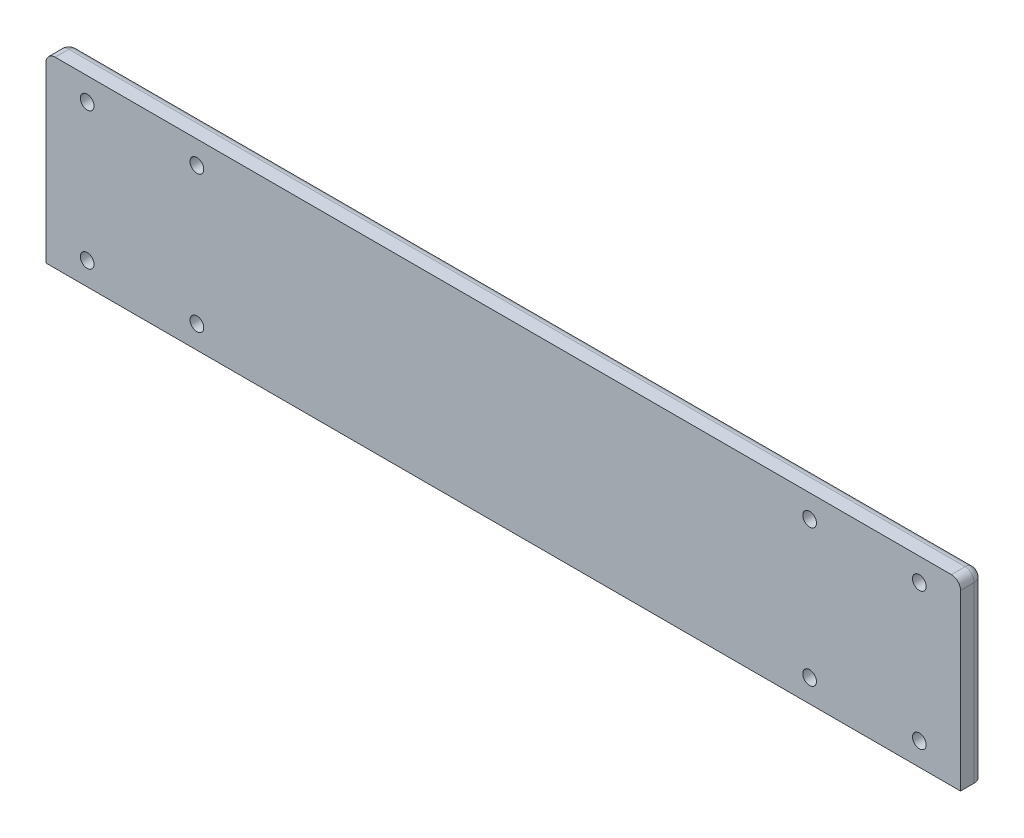
ISO-10303-21;
HEADER;
FILE_DESCRIPTION(('STEP AP214'),'2;1');
FILE_NAME('part.step','',(''),(''),'','','');
FILE_SCHEMA(('AUTOMOTIVE_DESIGN { 1 0 10303 214 1 1 1 1 }'));
ENDSEC;
DATA;
#1=APPLICATION_CONTEXT('core data for automotive mechanical design processes');
#2=APPLICATION_PROTOCOL_DEFINITION('international standard','automotive_design',2000,#1);
#3=PRODUCT_CONTEXT('',#1,'mechanical');
#4=PRODUCT('Part','Part','',(#3));
#5=PRODUCT_RELATED_PRODUCT_CATEGORY('part','',(#4));
#6=PRODUCT_DEFINITION_FORMATION('','',#4);
#7=PRODUCT_DEFINITION_CONTEXT('part definition',#1,'design');
#8=PRODUCT_DEFINITION('design','',#6,#7);
#9=PRODUCT_DEFINITION_SHAPE('','',#8);
#10=(LENGTH_UNIT() NAMED_UNIT(*) SI_UNIT(.MILLI.,.METRE.));
#11=(NAMED_UNIT(*) PLANE_ANGLE_UNIT() SI_UNIT($,.RADIAN.));
#12=(NAMED_UNIT(*) SI_UNIT($,.STERADIAN.) SOLID_ANGLE_UNIT());
#13=UNCERTAINTY_MEASURE_WITH_UNIT(LENGTH_MEASURE(1.E-05),#10,'distance_accuracy_value','');
#14=(GEOMETRIC_REPRESENTATION_CONTEXT(3) GLOBAL_UNCERTAINTY_ASSIGNED_CONTEXT((#13)) GLOBAL_UNIT_ASSIGNED_CONTEXT((#10,
#11,#12)) REPRESENTATION_CONTEXT('',''));
#15=CARTESIAN_POINT('',(0.,0.,0.));
#16=DIRECTION('',(0.,0.,1.));
#17=DIRECTION('',(1.,0.,0.));
#18=AXIS2_PLACEMENT_3D('',#15,#16,#17);
#19=CARTESIAN_POINT('',(0.,0.,0.));
#20=DIRECTION('',(0.,0.,-1.));
#21=DIRECTION('',(-1.,0.,0.));
#22=AXIS2_PLACEMENT_3D('',#19,#20,#21);
#23=PLANE('',#22);
#24=CARTESIAN_POINT('',(9.00189846198868,5.00198054311343,0.));
#25=DIRECTION('',(0.,0.,-1.));
#26=DIRECTION('',(-1.,0.,0.));
#27=AXIS2_PLACEMENT_3D('',#24,#25,#26);
#28=CIRCLE('',#27,1.5);
#29=CARTESIAN_POINT('',(7.50189846198868,5.00198054311343,0.));
#30=VERTEX_POINT('',#29);
#31=EDGE_CURVE('E202',#30,#30,#28,.T.);
#32=ORIENTED_EDGE('',*,*,#31,.F.);
#33=EDGE_LOOP('',(#32));
#34=FACE_BOUND('',#33,.T.);
#35=CARTESIAN_POINT('',(9.00189846198868,34.9980194568865,0.));
#36=DIRECTION('',(0.,0.,-1.));
#37=DIRECTION('',(-1.,0.,0.));
#38=AXIS2_PLACEMENT_3D('',#35,#36,#37);
#39=CIRCLE('',#38,1.5);
#40=CARTESIAN_POINT('',(7.50189846198868,34.9980194568865,0.));
#41=VERTEX_POINT('',#40);
#42=EDGE_CURVE('E208',#41,#41,#39,.T.);
#43=ORIENTED_EDGE('',*,*,#42,.F.);
#44=EDGE_LOOP('',(#43));
#45=FACE_BOUND('',#44,.T.);
#46=CARTESIAN_POINT('',(33.0008939766063,34.9980194568865,0.));
#47=DIRECTION('',(0.,0.,-1.));
#48=DIRECTION('',(-1.,0.,0.));
#49=AXIS2_PLACEMENT_3D('',#46,#47,#48);
#50=CIRCLE('',#49,1.5);
#51=CARTESIAN_POINT('',(31.5008939766063,34.9980194568865,0.));
#52=VERTEX_POINT('',#51);
#53=EDGE_CURVE('E214',#52,#52,#50,.T.);
#54=ORIENTED_EDGE('',*,*,#53,.F.);
#55=EDGE_LOOP('',(#54));
#56=FACE_BOUND('',#55,.T.);
#57=CARTESIAN_POINT('',(190.998101538011,5.00198054311344,0.));
#58=DIRECTION('',(0.,0.,-1.));
#59=DIRECTION('',(-1.,0.,0.));
#60=AXIS2_PLACEMENT_3D('',#57,#58,#59);
#61=CIRCLE('',#60,1.5);
#62=CARTESIAN_POINT('',(189.498101538011,5.00198054311344,0.));
#63=VERTEX_POINT('',#62);
#64=EDGE_CURVE('E181',#63,#63,#61,.T.);
#65=ORIENTED_EDGE('',*,*,#64,.F.);
#66=EDGE_LOOP('',(#65));
#67=FACE_BOUND('',#66,.T.);
#68=CARTESIAN_POINT('',(166.999106023394,5.00198054311344,0.));
#69=DIRECTION('',(0.,0.,-1.));
#70=DIRECTION('',(-1.,0.,0.));
#71=AXIS2_PLACEMENT_3D('',#68,#69,#70);
#72=CIRCLE('',#71,1.5);
#73=CARTESIAN_POINT('',(165.499106023394,5.00198054311344,0.));
#74=VERTEX_POINT('',#73);
#75=EDGE_CURVE('E182',#74,#74,#72,.T.);
#76=ORIENTED_EDGE('',*,*,#75,.F.);
#77=EDGE_LOOP('',(#76));
#78=FACE_BOUND('',#77,.T.);
#79=CARTESIAN_POINT('',(166.999106023394,34.9980194568865,0.));
#80=DIRECTION('',(0.,0.,-1.));
#81=DIRECTION('',(-1.,0.,0.));
#82=AXIS2_PLACEMENT_3D('',#79,#80,#81);
#83=CIRCLE('',#82,1.5);
#84=CARTESIAN_POINT('',(165.499106023394,34.9980194568865,0.));
#85=VERTEX_POINT('',#84);
#86=EDGE_CURVE('E188',#85,#85,#83,.T.);
#87=ORIENTED_EDGE('',*,*,#86,.F.);
#88=EDGE_LOOP('',(#87));
#89=FACE_BOUND('',#88,.T.);
#90=CARTESIAN_POINT('',(190.998101538011,34.9980194568865,0.));
#91=DIRECTION('',(0.,0.,-1.));
#92=DIRECTION('',(-1.,0.,0.));
#93=AXIS2_PLACEMENT_3D('',#90,#91,#92);
#94=CIRCLE('',#93,1.5);
#95=CARTESIAN_POINT('',(189.498101538011,34.9980194568865,0.));
#96=VERTEX_POINT('',#95);
#97=EDGE_CURVE('E194',#96,#96,#94,.T.);
#98=ORIENTED_EDGE('',*,*,#97,.F.);
#99=EDGE_LOOP('',(#98));
#100=FACE_BOUND('',#99,.T.);
#101=CARTESIAN_POINT('',(33.0008939766063,5.00198054311343,0.));
#102=DIRECTION('',(0.,0.,-1.));
#103=DIRECTION('',(-1.,0.,0.));
#104=AXIS2_PLACEMENT_3D('',#101,#102,#103);
#105=CIRCLE('',#104,1.5);
#106=CARTESIAN_POINT('',(31.5008939766063,5.00198054311343,0.));
#107=VERTEX_POINT('',#106);
#108=EDGE_CURVE('E201',#107,#107,#105,.T.);
#109=ORIENTED_EDGE('',*,*,#108,.F.);
#110=EDGE_LOOP('',(#109));
#111=FACE_BOUND('',#110,.T.);
#112=DIRECTION('',(0.,-1.,0.));
#113=VECTOR('',#112,1.);
#114=CARTESIAN_POINT('',(2.,40.,0.));
#115=LINE('',#114,#113);
#116=CARTESIAN_POINT('',(2.,0.,0.));
#117=VERTEX_POINT('',#116);
#118=CARTESIAN_POINT('',(2.,38.,0.));
#119=VERTEX_POINT('',#118);
#120=EDGE_CURVE('E249',#117,#119,#115,.F.);
#121=ORIENTED_EDGE('',*,*,#120,.T.);
#122=DIRECTION('',(-1.,0.,0.));
#123=VECTOR('',#122,1.);
#124=CARTESIAN_POINT('',(198.,38.,0.));
#125=LINE('',#124,#123);
#126=CARTESIAN_POINT('',(198.,38.,0.));
#127=VERTEX_POINT('',#126);
#128=EDGE_CURVE('E279',#119,#127,#125,.F.);
#129=ORIENTED_EDGE('',*,*,#128,.T.);
#130=DIRECTION('',(0.,1.,0.));
#131=VECTOR('',#130,1.);
#132=CARTESIAN_POINT('',(198.,0.,0.));
#133=LINE('',#132,#131);
#134=CARTESIAN_POINT('',(198.,0.,0.));
#135=VERTEX_POINT('',#134);
#136=EDGE_CURVE('E252',#127,#135,#133,.F.);
#137=ORIENTED_EDGE('',*,*,#136,.T.);
#138=DIRECTION('',(1.,0.,0.));
#139=VECTOR('',#138,1.);
#140=CARTESIAN_POINT('',(0.,0.,0.));
#141=LINE('',#140,#139);
#142=EDGE_CURVE('E225',#117,#135,#141,.T.);
#143=ORIENTED_EDGE('',*,*,#142,.F.);
#144=EDGE_LOOP('',(#121,#129,#137,#143));
#145=FACE_BOUND('',#144,.T.);
#146=DIRECTION('',(0.,1.,0.));
#147=VECTOR('',#146,1.);
#148=CARTESIAN_POINT('',(42.,14.9965885640372,0.));
#149=LINE('',#148,#147);
#150=CARTESIAN_POINT('',(42.,13.9965885640372,0.));
#151=VERTEX_POINT('',#150);
#152=CARTESIAN_POINT('',(42.,26.0927039023286,0.));
#153=VERTEX_POINT('',#152);
#154=EDGE_CURVE('E56',#151,#153,#149,.T.);
#155=ORIENTED_EDGE('',*,*,#154,.F.);
#156=DIRECTION('',(-1.,0.,0.));
#157=VECTOR('',#156,1.);
#158=CARTESIAN_POINT('',(0.,13.9965885640372,0.));
#159=LINE('',#158,#157);
#160=CARTESIAN_POINT('',(158.,13.9965885640372,0.));
#161=VERTEX_POINT('',#160);
#162=EDGE_CURVE('E309',#151,#161,#159,.F.);
#163=ORIENTED_EDGE('',*,*,#162,.T.);
#164=DIRECTION('',(0.,-1.,0.));
#165=VECTOR('',#164,1.);
#166=CARTESIAN_POINT('',(158.,14.9965885640372,0.));
#167=LINE('',#166,#165);
#168=CARTESIAN_POINT('',(158.,25.9984640434786,0.));
#169=VERTEX_POINT('',#168);
#170=EDGE_CURVE('E63',#169,#161,#167,.T.);
#171=ORIENTED_EDGE('',*,*,#170,.F.);
#172=DIRECTION('',(0.999998679937245,-0.00162484576741661,0.));
#173=VECTOR('',#172,1.);
#174=CARTESIAN_POINT('',(0.0426605780516426,26.2551206966737,0.));
#175=LINE('',#174,#173);
#176=CARTESIAN_POINT('',(100.000000002145,26.0927052223896,0.));
#177=VERTEX_POINT('',#176);
#178=EDGE_CURVE('E295',#169,#177,#175,.F.);
#179=ORIENTED_EDGE('',*,*,#178,.T.);
#180=DIRECTION('',(1.,0.,0.));
#181=VECTOR('',#180,1.);
#182=CARTESIAN_POINT('',(0.,26.0927039023286,0.));
#183=LINE('',#182,#181);
#184=EDGE_CURVE('E297',#177,#153,#183,.F.);
#185=ORIENTED_EDGE('',*,*,#184,.T.);
#186=EDGE_LOOP('',(#155,#163,#171,#179,#185));
#187=FACE_BOUND('',#186,.T.);
#188=ADVANCED_FACE('F41',(#34,#45,#56,#67,#78,#89,#100,#111,#145,#187),#23,.T.);
#189=CARTESIAN_POINT('',(0.,0.,5.));
#190=DIRECTION('',(1.,0.,0.));
#191=DIRECTION('',(0.,0.,-1.));
#192=AXIS2_PLACEMENT_3D('',#189,#190,#191);
#193=PLANE('',#192);
#194=DIRECTION('',(0.,-1.,0.));
#195=VECTOR('',#194,1.);
#196=CARTESIAN_POINT('',(0.,0.,5.));
#197=LINE('',#196,#195);
#198=CARTESIAN_POINT('',(0.,38.,5.));
#199=VERTEX_POINT('',#198);
#200=CARTESIAN_POINT('',(0.,0.,5.));
#201=VERTEX_POINT('',#200);
#202=EDGE_CURVE('E228',#199,#201,#197,.T.);
#203=ORIENTED_EDGE('',*,*,#202,.F.);
#204=DIRECTION('',(0.,0.,-1.));
#205=VECTOR('',#204,1.);
#206=CARTESIAN_POINT('',(0.,38.,5.));
#207=LINE('',#206,#205);
#208=CARTESIAN_POINT('',(0.,38.,2.));
#209=VERTEX_POINT('',#208);
#210=EDGE_CURVE('E275',#199,#209,#207,.T.);
#211=ORIENTED_EDGE('',*,*,#210,.T.);
#212=DIRECTION('',(0.,-1.,0.));
#213=VECTOR('',#212,1.);
#214=CARTESIAN_POINT('',(0.,0.,2.));
#215=LINE('',#214,#213);
#216=CARTESIAN_POINT('',(0.,0.,2.));
#217=VERTEX_POINT('',#216);
#218=EDGE_CURVE('E258',#209,#217,#215,.T.);
#219=ORIENTED_EDGE('',*,*,#218,.T.);
#220=DIRECTION('',(0.,0.,-1.));
#221=VECTOR('',#220,1.);
#222=CARTESIAN_POINT('',(0.,0.,5.));
#223=LINE('',#222,#221);
#224=EDGE_CURVE('E243',#201,#217,#223,.T.);
#225=ORIENTED_EDGE('',*,*,#224,.F.);
#226=EDGE_LOOP('',(#203,#211,#219,#225));
#227=FACE_BOUND('',#226,.T.);
#228=ADVANCED_FACE('F352',(#227),#193,.F.);
#229=CARTESIAN_POINT('',(0.,0.,5.));
#230=DIRECTION('',(0.,1.,0.));
#231=DIRECTION('',(0.,0.,1.));
#232=AXIS2_PLACEMENT_3D('',#229,#230,#231);
#233=PLANE('',#232);
#234=ORIENTED_EDGE('',*,*,#142,.T.);
#235=CARTESIAN_POINT('',(198.,0.,2.));
#236=DIRECTION('',(0.,1.,0.));
#237=DIRECTION('',(0.,0.,1.));
#238=AXIS2_PLACEMENT_3D('',#235,#236,#237);
#239=CIRCLE('',#238,2.);
#240=CARTESIAN_POINT('',(200.,0.,2.));
#241=VERTEX_POINT('',#240);
#242=EDGE_CURVE('E256',#135,#241,#239,.F.);
#243=ORIENTED_EDGE('',*,*,#242,.T.);
#244=DIRECTION('',(0.,0.,-1.));
#245=VECTOR('',#244,1.);
#246=CARTESIAN_POINT('',(200.,0.,5.));
#247=LINE('',#246,#245);
#248=CARTESIAN_POINT('',(200.,0.,5.));
#249=VERTEX_POINT('',#248);
#250=EDGE_CURVE('E238',#249,#241,#247,.T.);
#251=ORIENTED_EDGE('',*,*,#250,.F.);
#252=DIRECTION('',(1.,0.,0.));
#253=VECTOR('',#252,1.);
#254=CARTESIAN_POINT('',(0.,0.,5.));
#255=LINE('',#254,#253);
#256=EDGE_CURVE('E230',#201,#249,#255,.T.);
#257=ORIENTED_EDGE('',*,*,#256,.F.);
#258=ORIENTED_EDGE('',*,*,#224,.T.);
#259=CARTESIAN_POINT('',(2.,0.,2.));
#260=DIRECTION('',(0.,1.,0.));
#261=DIRECTION('',(0.,0.,1.));
#262=AXIS2_PLACEMENT_3D('',#259,#260,#261);
#263=CIRCLE('',#262,2.);
#264=EDGE_CURVE('E254',#217,#117,#263,.F.);
#265=ORIENTED_EDGE('',*,*,#264,.T.);
#266=EDGE_LOOP('',(#234,#243,#251,#257,#258,#265));
#267=FACE_BOUND('',#266,.T.);
#268=ADVANCED_FACE('F360',(#267),#233,.F.);
#269=CARTESIAN_POINT('',(200.,0.,5.));
#270=DIRECTION('',(-1.,0.,0.));
#271=DIRECTION('',(0.,0.,1.));
#272=AXIS2_PLACEMENT_3D('',#269,#270,#271);
#273=PLANE('',#272);
#274=DIRECTION('',(0.,1.,0.));
#275=VECTOR('',#274,1.);
#276=CARTESIAN_POINT('',(200.,40.,2.));
#277=LINE('',#276,#275);
#278=CARTESIAN_POINT('',(200.,38.,2.));
#279=VERTEX_POINT('',#278);
#280=EDGE_CURVE('E246',#241,#279,#277,.T.);
#281=ORIENTED_EDGE('',*,*,#280,.T.);
#282=DIRECTION('',(0.,0.,-1.));
#283=VECTOR('',#282,1.);
#284=CARTESIAN_POINT('',(200.,38.,5.));
#285=LINE('',#284,#283);
#286=CARTESIAN_POINT('',(200.,38.,5.));
#287=VERTEX_POINT('',#286);
#288=EDGE_CURVE('E267',#279,#287,#285,.F.);
#289=ORIENTED_EDGE('',*,*,#288,.T.);
#290=DIRECTION('',(0.,1.,0.));
#291=VECTOR('',#290,1.);
#292=CARTESIAN_POINT('',(200.,0.,5.));
#293=LINE('',#292,#291);
#294=EDGE_CURVE('E232',#249,#287,#293,.T.);
#295=ORIENTED_EDGE('',*,*,#294,.F.);
#296=ORIENTED_EDGE('',*,*,#250,.T.);
#297=EDGE_LOOP('',(#281,#289,#295,#296));
#298=FACE_BOUND('',#297,.T.);
#299=ADVANCED_FACE('F372',(#298),#273,.F.);
#300=CARTESIAN_POINT('',(0.,40.,5.));
#301=DIRECTION('',(0.,-1.,0.));
#302=DIRECTION('',(0.,0.,-1.));
#303=AXIS2_PLACEMENT_3D('',#300,#301,#302);
#304=PLANE('',#303);
#305=DIRECTION('',(-1.,0.,0.));
#306=VECTOR('',#305,1.);
#307=CARTESIAN_POINT('',(0.,40.,5.));
#308=LINE('',#307,#306);
#309=CARTESIAN_POINT('',(198.,40.,5.));
#310=VERTEX_POINT('',#309);
#311=CARTESIAN_POINT('',(2.,40.,5.));
#312=VERTEX_POINT('',#311);
#313=EDGE_CURVE('E235',#310,#312,#308,.T.);
#314=ORIENTED_EDGE('',*,*,#313,.F.);
#315=DIRECTION('',(0.,0.,-1.));
#316=VECTOR('',#315,1.);
#317=CARTESIAN_POINT('',(198.,40.,5.));
#318=LINE('',#317,#316);
#319=CARTESIAN_POINT('',(198.,40.,2.));
#320=VERTEX_POINT('',#319);
#321=EDGE_CURVE('E264',#310,#320,#318,.T.);
#322=ORIENTED_EDGE('',*,*,#321,.T.);
#323=DIRECTION('',(-1.,0.,0.));
#324=VECTOR('',#323,1.);
#325=CARTESIAN_POINT('',(2.,40.,2.));
#326=LINE('',#325,#324);
#327=CARTESIAN_POINT('',(2.,40.,2.));
#328=VERTEX_POINT('',#327);
#329=EDGE_CURVE('E260',#320,#328,#326,.T.);
#330=ORIENTED_EDGE('',*,*,#329,.T.);
#331=DIRECTION('',(0.,0.,-1.));
#332=VECTOR('',#331,1.);
#333=CARTESIAN_POINT('',(2.,40.,5.));
#334=LINE('',#333,#332);
#335=EDGE_CURVE('E262',#328,#312,#334,.F.);
#336=ORIENTED_EDGE('',*,*,#335,.T.);
#337=EDGE_LOOP('',(#314,#322,#330,#336));
#338=FACE_BOUND('',#337,.T.);
#339=ADVANCED_FACE('F369',(#338),#304,.F.);
#340=CARTESIAN_POINT('',(0.,0.,5.));
#341=DIRECTION('',(0.,0.,-1.));
#342=DIRECTION('',(-1.,0.,0.));
#343=AXIS2_PLACEMENT_3D('',#340,#341,#342);
#344=PLANE('',#343);
#345=CARTESIAN_POINT('',(9.00189846198868,5.00198054311343,5.));
#346=DIRECTION('',(0.,0.,-1.));
#347=DIRECTION('',(-1.,0.,0.));
#348=AXIS2_PLACEMENT_3D('',#345,#346,#347);
#349=CIRCLE('',#348,1.5);
#350=CARTESIAN_POINT('',(7.50189846198868,5.00198054311343,5.));
#351=VERTEX_POINT('',#350);
#352=EDGE_CURVE('E198',#351,#351,#349,.T.);
#353=ORIENTED_EDGE('',*,*,#352,.T.);
#354=EDGE_LOOP('',(#353));
#355=FACE_BOUND('',#354,.T.);
#356=CARTESIAN_POINT('',(9.00189846198868,34.9980194568865,5.));
#357=DIRECTION('',(0.,0.,-1.));
#358=DIRECTION('',(-1.,0.,0.));
#359=AXIS2_PLACEMENT_3D('',#356,#357,#358);
#360=CIRCLE('',#359,1.5);
#361=CARTESIAN_POINT('',(7.50189846198868,34.9980194568865,5.));
#362=VERTEX_POINT('',#361);
#363=EDGE_CURVE('E205',#362,#362,#360,.T.);
#364=ORIENTED_EDGE('',*,*,#363,.T.);
#365=EDGE_LOOP('',(#364));
#366=FACE_BOUND('',#365,.T.);
#367=CARTESIAN_POINT('',(33.0008939766063,34.9980194568865,5.));
#368=DIRECTION('',(0.,0.,-1.));
#369=DIRECTION('',(-1.,0.,0.));
#370=AXIS2_PLACEMENT_3D('',#367,#368,#369);
#371=CIRCLE('',#370,1.5);
#372=CARTESIAN_POINT('',(31.5008939766063,34.9980194568865,5.));
#373=VERTEX_POINT('',#372);
#374=EDGE_CURVE('E211',#373,#373,#371,.T.);
#375=ORIENTED_EDGE('',*,*,#374,.T.);
#376=EDGE_LOOP('',(#375));
#377=FACE_BOUND('',#376,.T.);
#378=CARTESIAN_POINT('',(190.998101538011,5.00198054311344,5.));
#379=DIRECTION('',(0.,0.,-1.));
#380=DIRECTION('',(-1.,0.,0.));
#381=AXIS2_PLACEMENT_3D('',#378,#379,#380);
#382=CIRCLE('',#381,1.5);
#383=CARTESIAN_POINT('',(189.498101538011,5.00198054311344,5.));
#384=VERTEX_POINT('',#383);
#385=EDGE_CURVE('E217',#384,#384,#382,.T.);
#386=ORIENTED_EDGE('',*,*,#385,.T.);
#387=EDGE_LOOP('',(#386));
#388=FACE_BOUND('',#387,.T.);
#389=CARTESIAN_POINT('',(166.999106023394,5.00198054311344,5.));
#390=DIRECTION('',(0.,0.,-1.));
#391=DIRECTION('',(-1.,0.,0.));
#392=AXIS2_PLACEMENT_3D('',#389,#390,#391);
#393=CIRCLE('',#392,1.5);
#394=CARTESIAN_POINT('',(165.499106023394,5.00198054311344,5.));
#395=VERTEX_POINT('',#394);
#396=EDGE_CURVE('E178',#395,#395,#393,.T.);
#397=ORIENTED_EDGE('',*,*,#396,.T.);
#398=EDGE_LOOP('',(#397));
#399=FACE_BOUND('',#398,.T.);
#400=CARTESIAN_POINT('',(166.999106023394,34.9980194568865,5.));
#401=DIRECTION('',(0.,0.,-1.));
#402=DIRECTION('',(-1.,0.,0.));
#403=AXIS2_PLACEMENT_3D('',#400,#401,#402);
#404=CIRCLE('',#403,1.5);
#405=CARTESIAN_POINT('',(165.499106023394,34.9980194568865,5.));
#406=VERTEX_POINT('',#405);
#407=EDGE_CURVE('E185',#406,#406,#404,.T.);
#408=ORIENTED_EDGE('',*,*,#407,.T.);
#409=EDGE_LOOP('',(#408));
#410=FACE_BOUND('',#409,.T.);
#411=CARTESIAN_POINT('',(190.998101538011,34.9980194568865,5.));
#412=DIRECTION('',(0.,0.,-1.));
#413=DIRECTION('',(-1.,0.,0.));
#414=AXIS2_PLACEMENT_3D('',#411,#412,#413);
#415=CIRCLE('',#414,1.5);
#416=CARTESIAN_POINT('',(189.498101538011,34.9980194568865,5.));
#417=VERTEX_POINT('',#416);
#418=EDGE_CURVE('E191',#417,#417,#415,.T.);
#419=ORIENTED_EDGE('',*,*,#418,.T.);
#420=EDGE_LOOP('',(#419));
#421=FACE_BOUND('',#420,.T.);
#422=CARTESIAN_POINT('',(33.0008939766063,5.00198054311343,5.));
#423=DIRECTION('',(0.,0.,-1.));
#424=DIRECTION('',(-1.,0.,0.));
#425=AXIS2_PLACEMENT_3D('',#422,#423,#424);
#426=CIRCLE('',#425,1.5);
#427=CARTESIAN_POINT('',(31.5008939766063,5.00198054311343,5.));
#428=VERTEX_POINT('',#427);
#429=EDGE_CURVE('E222',#428,#428,#426,.T.);
#430=ORIENTED_EDGE('',*,*,#429,.T.);
#431=EDGE_LOOP('',(#430));
#432=FACE_BOUND('',#431,.T.);
#433=ORIENTED_EDGE('',*,*,#294,.T.);
#434=CARTESIAN_POINT('',(198.,38.,5.));
#435=DIRECTION('',(0.,0.,-1.));
#436=DIRECTION('',(-1.,0.,0.));
#437=AXIS2_PLACEMENT_3D('',#434,#435,#436);
#438=CIRCLE('',#437,2.);
#439=EDGE_CURVE('E271',#287,#310,#438,.F.);
#440=ORIENTED_EDGE('',*,*,#439,.T.);
#441=ORIENTED_EDGE('',*,*,#313,.T.);
#442=CARTESIAN_POINT('',(2.,38.,5.));
#443=DIRECTION('',(0.,0.,-1.));
#444=DIRECTION('',(-1.,0.,0.));
#445=AXIS2_PLACEMENT_3D('',#442,#443,#444);
#446=CIRCLE('',#445,2.);
#447=EDGE_CURVE('E269',#312,#199,#446,.F.);
#448=ORIENTED_EDGE('',*,*,#447,.T.);
#449=ORIENTED_EDGE('',*,*,#202,.T.);
#450=ORIENTED_EDGE('',*,*,#256,.T.);
#451=EDGE_LOOP('',(#433,#440,#441,#448,#449,#450));
#452=FACE_BOUND('',#451,.T.);
#453=ADVANCED_FACE('F367',(#355,#366,#377,#388,#399,#410,#421,#432,#452),#344,.F.);
#454=CARTESIAN_POINT('',(198.,0.,2.));
#455=DIRECTION('',(0.,-1.,0.));
#456=DIRECTION('',(0.,0.,-1.));
#457=AXIS2_PLACEMENT_3D('',#454,#455,#456);
#458=CYLINDRICAL_SURFACE('',#457,2.);
#459=ORIENTED_EDGE('',*,*,#136,.F.);
#460=CARTESIAN_POINT('',(198.,38.,2.));
#461=DIRECTION('',(0.,-1.,0.));
#462=DIRECTION('',(0.,0.,-1.));
#463=AXIS2_PLACEMENT_3D('',#460,#461,#462);
#464=CIRCLE('',#463,2.);
#465=EDGE_CURVE('E273',#127,#279,#464,.T.);
#466=ORIENTED_EDGE('',*,*,#465,.T.);
#467=ORIENTED_EDGE('',*,*,#280,.F.);
#468=ORIENTED_EDGE('',*,*,#242,.F.);
#469=EDGE_LOOP('',(#459,#466,#467,#468));
#470=FACE_BOUND('',#469,.T.);
#471=ADVANCED_FACE('F380',(#470),#458,.T.);
#472=CARTESIAN_POINT('',(2.,0.,2.));
#473=DIRECTION('',(0.,1.,0.));
#474=DIRECTION('',(0.,0.,1.));
#475=AXIS2_PLACEMENT_3D('',#472,#473,#474);
#476=CYLINDRICAL_SURFACE('',#475,2.);
#477=ORIENTED_EDGE('',*,*,#218,.F.);
#478=CARTESIAN_POINT('',(2.,38.,2.));
#479=DIRECTION('',(0.,1.,0.));
#480=DIRECTION('',(0.,0.,1.));
#481=AXIS2_PLACEMENT_3D('',#478,#479,#480);
#482=CIRCLE('',#481,2.);
#483=EDGE_CURVE('E277',#209,#119,#482,.F.);
#484=ORIENTED_EDGE('',*,*,#483,.T.);
#485=ORIENTED_EDGE('',*,*,#120,.F.);
#486=ORIENTED_EDGE('',*,*,#264,.F.);
#487=EDGE_LOOP('',(#477,#484,#485,#486));
#488=FACE_BOUND('',#487,.T.);
#489=ADVANCED_FACE('F383',(#488),#476,.T.);
#490=CARTESIAN_POINT('',(33.0008939766063,5.00198054311343,5.));
#491=DIRECTION('',(0.,0.,-1.));
#492=DIRECTION('',(-1.,0.,0.));
#493=AXIS2_PLACEMENT_3D('',#490,#491,#492);
#494=CYLINDRICAL_SURFACE('',#493,1.5);
#495=ORIENTED_EDGE('',*,*,#429,.F.);
#496=EDGE_LOOP('',(#495));
#497=FACE_BOUND('',#496,.T.);
#498=ORIENTED_EDGE('',*,*,#108,.T.);
#499=EDGE_LOOP('',(#498));
#500=FACE_BOUND('',#499,.T.);
#501=ADVANCED_FACE('F387',(#497,#500),#494,.F.);
#502=CARTESIAN_POINT('',(190.998101538011,34.9980194568865,5.));
#503=DIRECTION('',(0.,0.,-1.));
#504=DIRECTION('',(-1.,0.,0.));
#505=AXIS2_PLACEMENT_3D('',#502,#503,#504);
#506=CYLINDRICAL_SURFACE('',#505,1.5);
#507=ORIENTED_EDGE('',*,*,#418,.F.);
#508=EDGE_LOOP('',(#507));
#509=FACE_BOUND('',#508,.T.);
#510=ORIENTED_EDGE('',*,*,#97,.T.);
#511=EDGE_LOOP('',(#510));
#512=FACE_BOUND('',#511,.T.);
#513=ADVANCED_FACE('F597',(#509,#512),#506,.F.);
#514=CARTESIAN_POINT('',(166.999106023394,34.9980194568865,5.));
#515=DIRECTION('',(0.,0.,-1.));
#516=DIRECTION('',(-1.,0.,0.));
#517=AXIS2_PLACEMENT_3D('',#514,#515,#516);
#518=CYLINDRICAL_SURFACE('',#517,1.5);
#519=ORIENTED_EDGE('',*,*,#407,.F.);
#520=EDGE_LOOP('',(#519));
#521=FACE_BOUND('',#520,.T.);
#522=ORIENTED_EDGE('',*,*,#86,.T.);
#523=EDGE_LOOP('',(#522));
#524=FACE_BOUND('',#523,.T.);
#525=ADVANCED_FACE('F587',(#521,#524),#518,.F.);
#526=CARTESIAN_POINT('',(166.999106023394,5.00198054311344,5.));
#527=DIRECTION('',(0.,0.,-1.));
#528=DIRECTION('',(-1.,0.,0.));
#529=AXIS2_PLACEMENT_3D('',#526,#527,#528);
#530=CYLINDRICAL_SURFACE('',#529,1.5);
#531=ORIENTED_EDGE('',*,*,#396,.F.);
#532=EDGE_LOOP('',(#531));
#533=FACE_BOUND('',#532,.T.);
#534=ORIENTED_EDGE('',*,*,#75,.T.);
#535=EDGE_LOOP('',(#534));
#536=FACE_BOUND('',#535,.T.);
#537=ADVANCED_FACE('F577',(#533,#536),#530,.F.);
#538=CARTESIAN_POINT('',(190.998101538011,5.00198054311344,5.));
#539=DIRECTION('',(0.,0.,-1.));
#540=DIRECTION('',(-1.,0.,0.));
#541=AXIS2_PLACEMENT_3D('',#538,#539,#540);
#542=CYLINDRICAL_SURFACE('',#541,1.5);
#543=ORIENTED_EDGE('',*,*,#385,.F.);
#544=EDGE_LOOP('',(#543));
#545=FACE_BOUND('',#544,.T.);
#546=ORIENTED_EDGE('',*,*,#64,.T.);
#547=EDGE_LOOP('',(#546));
#548=FACE_BOUND('',#547,.T.);
#549=ADVANCED_FACE('F567',(#545,#548),#542,.F.);
#550=CARTESIAN_POINT('',(33.0008939766063,34.9980194568865,5.));
#551=DIRECTION('',(0.,0.,-1.));
#552=DIRECTION('',(-1.,0.,0.));
#553=AXIS2_PLACEMENT_3D('',#550,#551,#552);
#554=CYLINDRICAL_SURFACE('',#553,1.5);
#555=ORIENTED_EDGE('',*,*,#374,.F.);
#556=EDGE_LOOP('',(#555));
#557=FACE_BOUND('',#556,.T.);
#558=ORIENTED_EDGE('',*,*,#53,.T.);
#559=EDGE_LOOP('',(#558));
#560=FACE_BOUND('',#559,.T.);
#561=ADVANCED_FACE('F557',(#557,#560),#554,.F.);
#562=CARTESIAN_POINT('',(9.00189846198868,34.9980194568865,5.));
#563=DIRECTION('',(0.,0.,-1.));
#564=DIRECTION('',(-1.,0.,0.));
#565=AXIS2_PLACEMENT_3D('',#562,#563,#564);
#566=CYLINDRICAL_SURFACE('',#565,1.5);
#567=ORIENTED_EDGE('',*,*,#363,.F.);
#568=EDGE_LOOP('',(#567));
#569=FACE_BOUND('',#568,.T.);
#570=ORIENTED_EDGE('',*,*,#42,.T.);
#571=EDGE_LOOP('',(#570));
#572=FACE_BOUND('',#571,.T.);
#573=ADVANCED_FACE('F547',(#569,#572),#566,.F.);
#574=CARTESIAN_POINT('',(9.00189846198868,5.00198054311343,5.));
#575=DIRECTION('',(0.,0.,-1.));
#576=DIRECTION('',(-1.,0.,0.));
#577=AXIS2_PLACEMENT_3D('',#574,#575,#576);
#578=CYLINDRICAL_SURFACE('',#577,1.5);
#579=ORIENTED_EDGE('',*,*,#352,.F.);
#580=EDGE_LOOP('',(#579));
#581=FACE_BOUND('',#580,.T.);
#582=ORIENTED_EDGE('',*,*,#31,.T.);
#583=EDGE_LOOP('',(#582));
#584=FACE_BOUND('',#583,.T.);
#585=ADVANCED_FACE('F408',(#581,#584),#578,.F.);
#586=CARTESIAN_POINT('',(2.,38.,5.));
#587=DIRECTION('',(0.,0.,-1.));
#588=DIRECTION('',(-1.,0.,0.));
#589=AXIS2_PLACEMENT_3D('',#586,#587,#588);
#590=CYLINDRICAL_SURFACE('',#589,2.);
#591=CARTESIAN_POINT('',(2.,38.,2.));
#592=DIRECTION('',(0.,0.,-1.));
#593=DIRECTION('',(-1.,0.,0.));
#594=AXIS2_PLACEMENT_3D('',#591,#592,#593);
#595=CIRCLE('',#594,2.);
#596=EDGE_CURVE('E197',#209,#328,#595,.T.);
#597=ORIENTED_EDGE('',*,*,#596,.F.);
#598=ORIENTED_EDGE('',*,*,#210,.F.);
#599=ORIENTED_EDGE('',*,*,#447,.F.);
#600=ORIENTED_EDGE('',*,*,#335,.F.);
#601=EDGE_LOOP('',(#597,#598,#599,#600));
#602=FACE_BOUND('',#601,.T.);
#603=ADVANCED_FACE('F404',(#602),#590,.T.);
#604=CARTESIAN_POINT('',(2.,38.,2.));
#605=DIRECTION('',(0.,-1.,0.));
#606=DIRECTION('',(0.,0.,-1.));
#607=AXIS2_PLACEMENT_3D('',#604,#605,#606);
#608=SPHERICAL_SURFACE('',#607,2.);
#609=ORIENTED_EDGE('',*,*,#483,.F.);
#610=ORIENTED_EDGE('',*,*,#596,.T.);
#611=CARTESIAN_POINT('',(2.,38.,2.));
#612=DIRECTION('',(1.,0.,0.));
#613=DIRECTION('',(0.,0.,-1.));
#614=AXIS2_PLACEMENT_3D('',#611,#612,#613);
#615=CIRCLE('',#614,2.);
#616=EDGE_CURVE('E288',#119,#328,#615,.T.);
#617=ORIENTED_EDGE('',*,*,#616,.F.);
#618=EDGE_LOOP('',(#609,#610,#617));
#619=FACE_BOUND('',#618,.T.);
#620=ADVANCED_FACE('F400',(#619),#608,.T.);
#621=CARTESIAN_POINT('',(0.,38.,2.));
#622=DIRECTION('',(1.,0.,0.));
#623=DIRECTION('',(0.,0.,-1.));
#624=AXIS2_PLACEMENT_3D('',#621,#622,#623);
#625=CYLINDRICAL_SURFACE('',#624,2.);
#626=CARTESIAN_POINT('',(198.,38.,2.));
#627=DIRECTION('',(1.,0.,0.));
#628=DIRECTION('',(0.,0.,-1.));
#629=AXIS2_PLACEMENT_3D('',#626,#627,#628);
#630=CIRCLE('',#629,2.);
#631=EDGE_CURVE('E284',#127,#320,#630,.T.);
#632=ORIENTED_EDGE('',*,*,#631,.F.);
#633=ORIENTED_EDGE('',*,*,#128,.F.);
#634=ORIENTED_EDGE('',*,*,#616,.T.);
#635=ORIENTED_EDGE('',*,*,#329,.F.);
#636=EDGE_LOOP('',(#632,#633,#634,#635));
#637=FACE_BOUND('',#636,.T.);
#638=ADVANCED_FACE('F396',(#637),#625,.T.);
#639=CARTESIAN_POINT('',(198.,38.,2.));
#640=DIRECTION('',(0.,-1.,0.));
#641=DIRECTION('',(0.,0.,-1.));
#642=AXIS2_PLACEMENT_3D('',#639,#640,#641);
#643=SPHERICAL_SURFACE('',#642,2.);
#644=ORIENTED_EDGE('',*,*,#465,.F.);
#645=ORIENTED_EDGE('',*,*,#631,.T.);
#646=CARTESIAN_POINT('',(198.,38.,2.));
#647=DIRECTION('',(0.,0.,1.));
#648=DIRECTION('',(1.,0.,0.));
#649=AXIS2_PLACEMENT_3D('',#646,#647,#648);
#650=CIRCLE('',#649,2.);
#651=EDGE_CURVE('E282',#279,#320,#650,.T.);
#652=ORIENTED_EDGE('',*,*,#651,.F.);
#653=EDGE_LOOP('',(#644,#645,#652));
#654=FACE_BOUND('',#653,.T.);
#655=ADVANCED_FACE('F392',(#654),#643,.T.);
#656=CARTESIAN_POINT('',(198.,38.,5.));
#657=DIRECTION('',(0.,0.,-1.));
#658=DIRECTION('',(-1.,0.,0.));
#659=AXIS2_PLACEMENT_3D('',#656,#657,#658);
#660=CYLINDRICAL_SURFACE('',#659,2.);
#661=ORIENTED_EDGE('',*,*,#439,.F.);
#662=ORIENTED_EDGE('',*,*,#288,.F.);
#663=ORIENTED_EDGE('',*,*,#651,.T.);
#664=ORIENTED_EDGE('',*,*,#321,.F.);
#665=EDGE_LOOP('',(#661,#662,#663,#664));
#666=FACE_BOUND('',#665,.T.);
#667=ADVANCED_FACE('F389',(#666),#660,.T.);
#668=CARTESIAN_POINT('',(100.,14.9965885640372,-119.438531186734));
#669=DIRECTION('',(0.,1.,0.));
#670=DIRECTION('',(0.,0.,1.));
#671=AXIS2_PLACEMENT_3D('',#668,#669,#670);
#672=PLANE('',#671);
#673=DIRECTION('',(0.,0.,1.));
#674=VECTOR('',#673,1.);
#675=CARTESIAN_POINT('',(158.,14.9965885640372,-119.438531186734));
#676=LINE('',#675,#674);
#677=CARTESIAN_POINT('',(158.,14.9965885640372,-3.));
#678=VERTEX_POINT('',#677);
#679=CARTESIAN_POINT('',(158.,14.9965885640372,-1.));
#680=VERTEX_POINT('',#679);
#681=EDGE_CURVE('E161',#678,#680,#676,.T.);
#682=ORIENTED_EDGE('',*,*,#681,.T.);
#683=DIRECTION('',(-1.,0.,0.));
#684=VECTOR('',#683,1.);
#685=CARTESIAN_POINT('',(100.,14.9965885640372,-1.));
#686=LINE('',#685,#684);
#687=CARTESIAN_POINT('',(42.,14.9965885640372,-1.));
#688=VERTEX_POINT('',#687);
#689=EDGE_CURVE('E305',#680,#688,#686,.T.);
#690=ORIENTED_EDGE('',*,*,#689,.T.);
#691=DIRECTION('',(0.,0.,1.));
#692=VECTOR('',#691,1.);
#693=CARTESIAN_POINT('',(42.,14.9965885640372,-119.438531186734));
#694=LINE('',#693,#692);
#695=CARTESIAN_POINT('',(42.,14.9965885640372,-3.));
#696=VERTEX_POINT('',#695);
#697=EDGE_CURVE('E172',#696,#688,#694,.T.);
#698=ORIENTED_EDGE('',*,*,#697,.F.);
#699=DIRECTION('',(1.,0.,0.));
#700=VECTOR('',#699,1.);
#701=CARTESIAN_POINT('',(100.,14.9965885640372,-3.));
#702=LINE('',#701,#700);
#703=EDGE_CURVE('E153',#696,#678,#702,.T.);
#704=ORIENTED_EDGE('',*,*,#703,.T.);
#705=EDGE_LOOP('',(#682,#690,#698,#704));
#706=FACE_BOUND('',#705,.T.);
#707=ADVANCED_FACE('F170',(#706),#672,.F.);
#708=CARTESIAN_POINT('',(158.,14.9965885640372,-119.438531186734));
#709=DIRECTION('',(-1.,0.,0.));
#710=DIRECTION('',(0.,0.,1.));
#711=AXIS2_PLACEMENT_3D('',#708,#709,#710);
#712=PLANE('',#711);
#713=ORIENTED_EDGE('',*,*,#681,.F.);
#714=DIRECTION('',(0.,1.,0.));
#715=VECTOR('',#714,1.);
#716=CARTESIAN_POINT('',(158.,14.9965885640372,-3.));
#717=LINE('',#716,#715);
#718=CARTESIAN_POINT('',(158.,24.9984627234141,-3.));
#719=VERTEX_POINT('',#718);
#720=EDGE_CURVE('E149',#678,#719,#717,.T.);
#721=ORIENTED_EDGE('',*,*,#720,.T.);
#722=DIRECTION('',(0.,0.,1.));
#723=VECTOR('',#722,1.);
#724=CARTESIAN_POINT('',(158.,24.9984627234141,-119.438531186734));
#725=LINE('',#724,#723);
#726=CARTESIAN_POINT('',(158.,24.9984627234141,-1.));
#727=VERTEX_POINT('',#726);
#728=EDGE_CURVE('E167',#719,#727,#725,.T.);
#729=ORIENTED_EDGE('',*,*,#728,.T.);
#730=CARTESIAN_POINT('',(158.,25.9984640434786,-1.));
#731=DIRECTION('',(-1.,0.,0.));
#732=DIRECTION('',(0.,-1.,0.));
#733=AXIS2_PLACEMENT_3D('',#730,#731,#732);
#734=ELLIPSE('',#733,1.0000013200645,1.);
#735=EDGE_CURVE('E303',#727,#169,#734,.T.);
#736=ORIENTED_EDGE('',*,*,#735,.T.);
#737=ORIENTED_EDGE('',*,*,#170,.T.);
#738=CARTESIAN_POINT('',(158.,13.9965885640372,-1.));
#739=DIRECTION('',(-1.,0.,0.));
#740=DIRECTION('',(0.,0.,1.));
#741=AXIS2_PLACEMENT_3D('',#738,#739,#740);
#742=CIRCLE('',#741,1.);
#743=EDGE_CURVE('E11',#161,#680,#742,.T.);
#744=ORIENTED_EDGE('',*,*,#743,.T.);
#745=EDGE_LOOP('',(#713,#721,#729,#736,#737,#744));
#746=FACE_BOUND('',#745,.T.);
#747=ADVANCED_FACE('F162',(#746),#712,.F.);
#748=CARTESIAN_POINT('',(158.,24.9984627234141,-119.438531186734));
#749=DIRECTION('',(-0.00162484576741661,-0.999998679937245,0.));
#750=DIRECTION('',(0.999998679937245,-0.00162484576741661,0.));
#751=AXIS2_PLACEMENT_3D('',#748,#749,#750);
#752=PLANE('',#751);
#753=DIRECTION('',(0.,0.,1.));
#754=VECTOR('',#753,1.);
#755=CARTESIAN_POINT('',(100.,25.0927039023286,-119.438531186734));
#756=LINE('',#755,#754);
#757=CARTESIAN_POINT('',(100.,25.0927039023286,-3.));
#758=VERTEX_POINT('',#757);
#759=CARTESIAN_POINT('',(100.,25.0927039023286,-1.));
#760=VERTEX_POINT('',#759);
#761=EDGE_CURVE('E334',#758,#760,#756,.T.);
#762=ORIENTED_EDGE('',*,*,#761,.T.);
#763=DIRECTION('',(0.999998679937245,-0.00162484576741661,0.));
#764=VECTOR('',#763,1.);
#765=CARTESIAN_POINT('',(158.,24.9984627234141,-1.));
#766=LINE('',#765,#764);
#767=EDGE_CURVE('E299',#760,#727,#766,.T.);
#768=ORIENTED_EDGE('',*,*,#767,.T.);
#769=ORIENTED_EDGE('',*,*,#728,.F.);
#770=DIRECTION('',(-0.999998679937245,0.00162484576741661,0.));
#771=VECTOR('',#770,1.);
#772=CARTESIAN_POINT('',(158.,24.9984627234141,-3.));
#773=LINE('',#772,#771);
#774=EDGE_CURVE('E156',#719,#758,#773,.T.);
#775=ORIENTED_EDGE('',*,*,#774,.T.);
#776=EDGE_LOOP('',(#762,#768,#769,#775));
#777=FACE_BOUND('',#776,.T.);
#778=ADVANCED_FACE('F342',(#777),#752,.F.);
#779=CARTESIAN_POINT('',(42.,25.0927039023286,-119.438531186734));
#780=DIRECTION('',(0.,-1.,0.));
#781=DIRECTION('',(0.,0.,-1.));
#782=AXIS2_PLACEMENT_3D('',#779,#780,#781);
#783=PLANE('',#782);
#784=DIRECTION('',(0.,0.,1.));
#785=VECTOR('',#784,1.);
#786=CARTESIAN_POINT('',(42.,25.0927039023286,-119.438531186734));
#787=LINE('',#786,#785);
#788=CARTESIAN_POINT('',(42.,25.0927039023286,-3.));
#789=VERTEX_POINT('',#788);
#790=CARTESIAN_POINT('',(42.,25.0927039023286,-1.));
#791=VERTEX_POINT('',#790);
#792=EDGE_CURVE('E174',#789,#791,#787,.T.);
#793=ORIENTED_EDGE('',*,*,#792,.T.);
#794=DIRECTION('',(1.,0.,0.));
#795=VECTOR('',#794,1.);
#796=CARTESIAN_POINT('',(42.,25.0927039023286,-1.));
#797=LINE('',#796,#795);
#798=EDGE_CURVE('E281',#791,#760,#797,.T.);
#799=ORIENTED_EDGE('',*,*,#798,.T.);
#800=ORIENTED_EDGE('',*,*,#761,.F.);
#801=DIRECTION('',(-1.,0.,0.));
#802=VECTOR('',#801,1.);
#803=CARTESIAN_POINT('',(42.,25.0927039023286,-3.));
#804=LINE('',#803,#802);
#805=EDGE_CURVE('E333',#758,#789,#804,.T.);
#806=ORIENTED_EDGE('',*,*,#805,.T.);
#807=EDGE_LOOP('',(#793,#799,#800,#806));
#808=FACE_BOUND('',#807,.T.);
#809=ADVANCED_FACE('F330',(#808),#783,.F.);
#810=CARTESIAN_POINT('',(42.,14.9965885640372,-119.438531186734));
#811=DIRECTION('',(1.,0.,0.));
#812=DIRECTION('',(0.,0.,-1.));
#813=AXIS2_PLACEMENT_3D('',#810,#811,#812);
#814=PLANE('',#813);
#815=ORIENTED_EDGE('',*,*,#792,.F.);
#816=DIRECTION('',(0.,-1.,0.));
#817=VECTOR('',#816,1.);
#818=CARTESIAN_POINT('',(42.,14.9965885640372,-3.));
#819=LINE('',#818,#817);
#820=EDGE_CURVE('E285',#789,#696,#819,.T.);
#821=ORIENTED_EDGE('',*,*,#820,.T.);
#822=ORIENTED_EDGE('',*,*,#697,.T.);
#823=CARTESIAN_POINT('',(42.,13.9965885640372,-1.));
#824=DIRECTION('',(1.,0.,0.));
#825=DIRECTION('',(0.,0.,-1.));
#826=AXIS2_PLACEMENT_3D('',#823,#824,#825);
#827=CIRCLE('',#826,1.);
#828=EDGE_CURVE('E49',#688,#151,#827,.T.);
#829=ORIENTED_EDGE('',*,*,#828,.T.);
#830=ORIENTED_EDGE('',*,*,#154,.T.);
#831=CARTESIAN_POINT('',(42.,26.0927039023286,-1.));
#832=DIRECTION('',(1.,0.,0.));
#833=DIRECTION('',(0.,0.,-1.));
#834=AXIS2_PLACEMENT_3D('',#831,#832,#833);
#835=CIRCLE('',#834,1.);
#836=EDGE_CURVE('E301',#153,#791,#835,.T.);
#837=ORIENTED_EDGE('',*,*,#836,.T.);
#838=EDGE_LOOP('',(#815,#821,#822,#829,#830,#837));
#839=FACE_BOUND('',#838,.T.);
#840=ADVANCED_FACE('F313',(#839),#814,.F.);
#841=CARTESIAN_POINT('',(41.,1.,-3.));
#842=DIRECTION('',(0.,0.,1.));
#843=DIRECTION('',(0.,-1.,0.));
#844=AXIS2_PLACEMENT_3D('',#841,#842,#843);
#845=PLANE('',#844);
#846=ORIENTED_EDGE('',*,*,#805,.F.);
#847=ORIENTED_EDGE('',*,*,#774,.F.);
#848=ORIENTED_EDGE('',*,*,#720,.F.);
#849=ORIENTED_EDGE('',*,*,#703,.F.);
#850=ORIENTED_EDGE('',*,*,#820,.F.);
#851=EDGE_LOOP('',(#846,#847,#848,#849,#850));
#852=FACE_BOUND('',#851,.T.);
#853=ADVANCED_FACE('F151',(#852),#845,.F.);
#854=CARTESIAN_POINT('',(158.001624845767,25.9984614033514,-1.));
#855=DIRECTION('',(0.999998679937245,-0.00162484576741661,0.));
#856=DIRECTION('',(0.00162484576741661,0.999998679937245,0.));
#857=AXIS2_PLACEMENT_3D('',#854,#855,#856);
#858=CYLINDRICAL_SURFACE('',#857,1.);
#859=ORIENTED_EDGE('',*,*,#735,.F.);
#860=ORIENTED_EDGE('',*,*,#767,.F.);
#861=CARTESIAN_POINT('',(100.000000002145,26.0927052223896,-1.));
#862=DIRECTION('',(1.,-2.14489254103555E-09,0.));
#863=DIRECTION('',(2.14489254103555E-09,1.,0.));
#864=AXIS2_PLACEMENT_3D('',#861,#862,#863);
#865=CIRCLE('',#864,1.);
#866=EDGE_CURVE('E306',#177,#760,#865,.T.);
#867=ORIENTED_EDGE('',*,*,#866,.F.);
#868=ORIENTED_EDGE('',*,*,#178,.F.);
#869=EDGE_LOOP('',(#859,#860,#867,#868));
#870=FACE_BOUND('',#869,.T.);
#871=ADVANCED_FACE('F322',(#870),#858,.F.);
#872=CARTESIAN_POINT('',(42.,26.0927039023286,-1.));
#873=DIRECTION('',(1.,0.,0.));
#874=DIRECTION('',(0.,0.,-1.));
#875=AXIS2_PLACEMENT_3D('',#872,#873,#874);
#876=CYLINDRICAL_SURFACE('',#875,1.);
#877=ORIENTED_EDGE('',*,*,#836,.F.);
#878=ORIENTED_EDGE('',*,*,#184,.F.);
#879=ORIENTED_EDGE('',*,*,#866,.T.);
#880=ORIENTED_EDGE('',*,*,#798,.F.);
#881=EDGE_LOOP('',(#877,#878,#879,#880));
#882=FACE_BOUND('',#881,.T.);
#883=ADVANCED_FACE('F326',(#882),#876,.F.);
#884=CARTESIAN_POINT('',(100.,13.9965885640372,-1.));
#885=DIRECTION('',(-1.,0.,0.));
#886=DIRECTION('',(0.,0.,1.));
#887=AXIS2_PLACEMENT_3D('',#884,#885,#886);
#888=CYLINDRICAL_SURFACE('',#887,1.);
#889=ORIENTED_EDGE('',*,*,#743,.F.);
#890=ORIENTED_EDGE('',*,*,#162,.F.);
#891=ORIENTED_EDGE('',*,*,#828,.F.);
#892=ORIENTED_EDGE('',*,*,#689,.F.);
#893=EDGE_LOOP('',(#889,#890,#891,#892));
#894=FACE_BOUND('',#893,.T.);
#895=ADVANCED_FACE('F43',(#894),#888,.F.);
#896=CLOSED_SHELL('',(#188,#228,#268,#299,#339,#453,#471,#489,#501,#513,#525,#537,#549,#561,
#573,#585,#603,#620,#638,#655,#667,#707,#747,#778,#809,#840,#853,#871,#883,#895));
#897=MANIFOLD_SOLID_BREP('B2',#896);
#898=ADVANCED_BREP_SHAPE_REPRESENTATION('',(#18,#897),#14);
#899=SHAPE_DEFINITION_REPRESENTATION(#9,#898);
ENDSEC;
END-ISO-10303-21;
